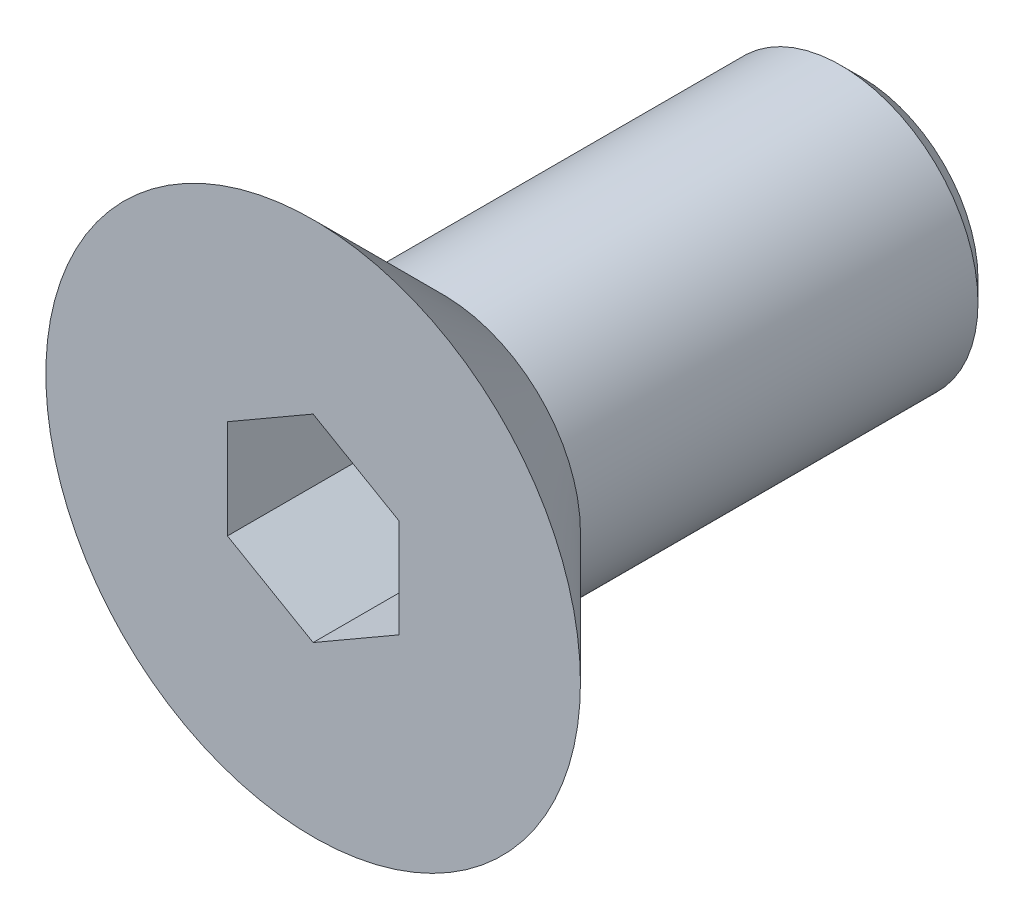
ISO-10303-21;
HEADER;
FILE_DESCRIPTION(('STEP AP214'),'2;1');
FILE_NAME('part.step','',(''),(''),'','','');
FILE_SCHEMA(('AUTOMOTIVE_DESIGN { 1 0 10303 214 1 1 1 1 }'));
ENDSEC;
DATA;
#1=APPLICATION_CONTEXT('core data for automotive mechanical design processes');
#2=APPLICATION_PROTOCOL_DEFINITION('international standard','automotive_design',2000,#1);
#3=PRODUCT_CONTEXT('',#1,'mechanical');
#4=PRODUCT('Part','Part','',(#3));
#5=PRODUCT_RELATED_PRODUCT_CATEGORY('part','',(#4));
#6=PRODUCT_DEFINITION_FORMATION('','',#4);
#7=PRODUCT_DEFINITION_CONTEXT('part definition',#1,'design');
#8=PRODUCT_DEFINITION('design','',#6,#7);
#9=PRODUCT_DEFINITION_SHAPE('','',#8);
#10=(LENGTH_UNIT() NAMED_UNIT(*) SI_UNIT(.MILLI.,.METRE.));
#11=(NAMED_UNIT(*) PLANE_ANGLE_UNIT() SI_UNIT($,.RADIAN.));
#12=(NAMED_UNIT(*) SI_UNIT($,.STERADIAN.) SOLID_ANGLE_UNIT());
#13=UNCERTAINTY_MEASURE_WITH_UNIT(LENGTH_MEASURE(1.E-05),#10,'distance_accuracy_value','');
#14=(GEOMETRIC_REPRESENTATION_CONTEXT(3) GLOBAL_UNCERTAINTY_ASSIGNED_CONTEXT((#13)) GLOBAL_UNIT_ASSIGNED_CONTEXT((#10,
#11,#12)) REPRESENTATION_CONTEXT('',''));
#15=CARTESIAN_POINT('',(0.,0.,0.));
#16=DIRECTION('',(0.,0.,1.));
#17=DIRECTION('',(1.,0.,0.));
#18=AXIS2_PLACEMENT_3D('',#15,#16,#17);
#19=CARTESIAN_POINT('',(0.,0.,2.3));
#20=DIRECTION('',(0.,0.,1.));
#21=DIRECTION('',(1.,0.,0.));
#22=AXIS2_PLACEMENT_3D('',#19,#20,#21);
#23=PLANE('',#22);
#24=CARTESIAN_POINT('',(0.,0.,2.3));
#25=DIRECTION('',(0.,0.,1.));
#26=DIRECTION('',(1.,0.,0.));
#27=AXIS2_PLACEMENT_3D('',#24,#25,#26);
#28=CIRCLE('',#27,3.89999999999996);
#29=CARTESIAN_POINT('',(3.89999999999996,0.,2.3));
#30=VERTEX_POINT('',#29);
#31=EDGE_CURVE('E42',#30,#30,#28,.T.);
#32=ORIENTED_EDGE('',*,*,#31,.T.);
#33=EDGE_LOOP('',(#32));
#34=FACE_BOUND('',#33,.T.);
#35=DIRECTION('',(-0.866025403784439,0.5,0.));
#36=VECTOR('',#35,1.);
#37=CARTESIAN_POINT('',(1.25,0.721687836487033,2.3));
#38=LINE('',#37,#36);
#39=CARTESIAN_POINT('',(1.25,0.721687836487033,2.3));
#40=VERTEX_POINT('',#39);
#41=CARTESIAN_POINT('',(0.,1.44337567297406,2.3));
#42=VERTEX_POINT('',#41);
#43=EDGE_CURVE('E49',#40,#42,#38,.T.);
#44=ORIENTED_EDGE('',*,*,#43,.F.);
#45=DIRECTION('',(0.,1.,0.));
#46=VECTOR('',#45,1.);
#47=CARTESIAN_POINT('',(1.25,-0.721687836487033,2.3));
#48=LINE('',#47,#46);
#49=CARTESIAN_POINT('',(1.25,-0.721687836487033,2.3));
#50=VERTEX_POINT('',#49);
#51=EDGE_CURVE('E132',#50,#40,#48,.T.);
#52=ORIENTED_EDGE('',*,*,#51,.F.);
#53=DIRECTION('',(0.866025403784439,0.5,0.));
#54=VECTOR('',#53,1.);
#55=CARTESIAN_POINT('',(0.,-1.44337567297406,2.3));
#56=LINE('',#55,#54);
#57=CARTESIAN_POINT('',(0.,-1.44337567297406,2.3));
#58=VERTEX_POINT('',#57);
#59=EDGE_CURVE('E130',#58,#50,#56,.T.);
#60=ORIENTED_EDGE('',*,*,#59,.F.);
#61=DIRECTION('',(0.866025403784439,-0.5,0.));
#62=VECTOR('',#61,1.);
#63=CARTESIAN_POINT('',(-1.25,-0.721687836487032,2.3));
#64=LINE('',#63,#62);
#65=CARTESIAN_POINT('',(-1.25,-0.721687836487032,2.3));
#66=VERTEX_POINT('',#65);
#67=EDGE_CURVE('E97',#66,#58,#64,.T.);
#68=ORIENTED_EDGE('',*,*,#67,.F.);
#69=DIRECTION('',(0.,-1.,0.));
#70=VECTOR('',#69,1.);
#71=CARTESIAN_POINT('',(-1.25,0.721687836487033,2.3));
#72=LINE('',#71,#70);
#73=CARTESIAN_POINT('',(-1.25,0.721687836487033,2.3));
#74=VERTEX_POINT('',#73);
#75=EDGE_CURVE('E126',#74,#66,#72,.T.);
#76=ORIENTED_EDGE('',*,*,#75,.F.);
#77=DIRECTION('',(-0.866025403784439,-0.5,0.));
#78=VECTOR('',#77,1.);
#79=CARTESIAN_POINT('',(0.,1.44337567297406,2.3));
#80=LINE('',#79,#78);
#81=EDGE_CURVE('E123',#42,#74,#80,.T.);
#82=ORIENTED_EDGE('',*,*,#81,.F.);
#83=EDGE_LOOP('',(#44,#52,#60,#68,#76,#82));
#84=FACE_BOUND('',#83,.T.);
#85=ADVANCED_FACE('F34',(#34,#84),#23,.T.);
#86=CARTESIAN_POINT('',(0.,0.,-5.7));
#87=DIRECTION('',(0.,0.,1.));
#88=DIRECTION('',(1.,0.,0.));
#89=AXIS2_PLACEMENT_3D('',#86,#87,#88);
#90=CYLINDRICAL_SURFACE('',#89,2.);
#91=CARTESIAN_POINT('',(0.,0.,0.400000000000021));
#92=DIRECTION('',(0.,0.,1.));
#93=DIRECTION('',(1.,0.,0.));
#94=AXIS2_PLACEMENT_3D('',#91,#92,#93);
#95=CIRCLE('',#94,2.);
#96=CARTESIAN_POINT('',(2.,0.,0.400000000000021));
#97=VERTEX_POINT('',#96);
#98=EDGE_CURVE('E11',#97,#97,#95,.F.);
#99=ORIENTED_EDGE('',*,*,#98,.T.);
#100=EDGE_LOOP('',(#99));
#101=FACE_BOUND('',#100,.T.);
#102=CARTESIAN_POINT('',(0.,0.,-5.4));
#103=DIRECTION('',(0.,0.,-1.));
#104=DIRECTION('',(-1.,0.,0.));
#105=AXIS2_PLACEMENT_3D('',#102,#103,#104);
#106=CIRCLE('',#105,2.);
#107=CARTESIAN_POINT('',(-2.,0.,-5.4));
#108=VERTEX_POINT('',#107);
#109=EDGE_CURVE('E144',#108,#108,#106,.F.);
#110=ORIENTED_EDGE('',*,*,#109,.T.);
#111=EDGE_LOOP('',(#110));
#112=FACE_BOUND('',#111,.T.);
#113=ADVANCED_FACE('F160',(#101,#112),#90,.T.);
#114=CARTESIAN_POINT('',(0.,0.,-5.7));
#115=DIRECTION('',(0.,0.,-1.));
#116=DIRECTION('',(-1.,0.,0.));
#117=AXIS2_PLACEMENT_3D('',#114,#115,#116);
#118=PLANE('',#117);
#119=CARTESIAN_POINT('',(0.,0.,-5.7));
#120=DIRECTION('',(0.,0.,-1.));
#121=DIRECTION('',(-1.,0.,0.));
#122=AXIS2_PLACEMENT_3D('',#119,#120,#121);
#123=CIRCLE('',#122,1.7);
#124=CARTESIAN_POINT('',(-1.7,0.,-5.7));
#125=VERTEX_POINT('',#124);
#126=EDGE_CURVE('E136',#125,#125,#123,.T.);
#127=ORIENTED_EDGE('',*,*,#126,.T.);
#128=EDGE_LOOP('',(#127));
#129=FACE_BOUND('',#128,.T.);
#130=ADVANCED_FACE('F165',(#129),#118,.T.);
#131=CARTESIAN_POINT('',(0.,0.,-5.7));
#132=DIRECTION('',(0.,0.,1.));
#133=DIRECTION('',(1.,0.,0.));
#134=AXIS2_PLACEMENT_3D('',#131,#132,#133);
#135=CONICAL_SURFACE('',#134,1.7,0.785398163397447);
#136=ORIENTED_EDGE('',*,*,#109,.F.);
#137=EDGE_LOOP('',(#136));
#138=FACE_BOUND('',#137,.T.);
#139=ORIENTED_EDGE('',*,*,#126,.F.);
#140=EDGE_LOOP('',(#139));
#141=FACE_BOUND('',#140,.T.);
#142=ADVANCED_FACE('F169',(#138,#141),#135,.T.);
#143=CARTESIAN_POINT('',(1.25,0.721687836487033,0.3));
#144=DIRECTION('',(0.5,0.866025403784439,0.));
#145=DIRECTION('',(-0.866025403784439,0.5,0.));
#146=AXIS2_PLACEMENT_3D('',#143,#144,#145);
#147=PLANE('',#146);
#148=ORIENTED_EDGE('',*,*,#43,.T.);
#149=DIRECTION('',(0.,0.,1.));
#150=VECTOR('',#149,1.);
#151=CARTESIAN_POINT('',(0.,1.44337567297406,0.3));
#152=LINE('',#151,#150);
#153=CARTESIAN_POINT('',(0.,1.44337567297406,0.3));
#154=VERTEX_POINT('',#153);
#155=EDGE_CURVE('E79',#154,#42,#152,.T.);
#156=ORIENTED_EDGE('',*,*,#155,.F.);
#157=DIRECTION('',(-0.866025403784439,0.5,0.));
#158=VECTOR('',#157,1.);
#159=CARTESIAN_POINT('',(1.25,0.721687836487033,0.3));
#160=LINE('',#159,#158);
#161=CARTESIAN_POINT('',(1.25,0.721687836487033,0.3));
#162=VERTEX_POINT('',#161);
#163=EDGE_CURVE('E134',#162,#154,#160,.T.);
#164=ORIENTED_EDGE('',*,*,#163,.F.);
#165=DIRECTION('',(0.,0.,1.));
#166=VECTOR('',#165,1.);
#167=CARTESIAN_POINT('',(1.25,0.721687836487033,0.3));
#168=LINE('',#167,#166);
#169=EDGE_CURVE('E57',#162,#40,#168,.T.);
#170=ORIENTED_EDGE('',*,*,#169,.T.);
#171=EDGE_LOOP('',(#148,#156,#164,#170));
#172=FACE_BOUND('',#171,.T.);
#173=ADVANCED_FACE('F171',(#172),#147,.F.);
#174=CARTESIAN_POINT('',(1.25,-0.721687836487033,0.3));
#175=DIRECTION('',(1.,0.,0.));
#176=DIRECTION('',(0.,1.,0.));
#177=AXIS2_PLACEMENT_3D('',#174,#175,#176);
#178=PLANE('',#177);
#179=ORIENTED_EDGE('',*,*,#51,.T.);
#180=ORIENTED_EDGE('',*,*,#169,.F.);
#181=DIRECTION('',(0.,1.,0.));
#182=VECTOR('',#181,1.);
#183=CARTESIAN_POINT('',(1.25,-0.721687836487033,0.3));
#184=LINE('',#183,#182);
#185=CARTESIAN_POINT('',(1.25,-0.721687836487033,0.3));
#186=VERTEX_POINT('',#185);
#187=EDGE_CURVE('E109',#186,#162,#184,.T.);
#188=ORIENTED_EDGE('',*,*,#187,.F.);
#189=DIRECTION('',(0.,0.,1.));
#190=VECTOR('',#189,1.);
#191=CARTESIAN_POINT('',(1.25,-0.721687836487033,0.3));
#192=LINE('',#191,#190);
#193=EDGE_CURVE('E101',#186,#50,#192,.T.);
#194=ORIENTED_EDGE('',*,*,#193,.T.);
#195=EDGE_LOOP('',(#179,#180,#188,#194));
#196=FACE_BOUND('',#195,.T.);
#197=ADVANCED_FACE('F177',(#196),#178,.F.);
#198=CARTESIAN_POINT('',(0.,-1.44337567297406,0.3));
#199=DIRECTION('',(0.5,-0.866025403784439,0.));
#200=DIRECTION('',(0.866025403784439,0.5,0.));
#201=AXIS2_PLACEMENT_3D('',#198,#199,#200);
#202=PLANE('',#201);
#203=ORIENTED_EDGE('',*,*,#59,.T.);
#204=ORIENTED_EDGE('',*,*,#193,.F.);
#205=DIRECTION('',(0.866025403784439,0.5,0.));
#206=VECTOR('',#205,1.);
#207=CARTESIAN_POINT('',(0.,-1.44337567297406,0.3));
#208=LINE('',#207,#206);
#209=CARTESIAN_POINT('',(0.,-1.44337567297406,0.3));
#210=VERTEX_POINT('',#209);
#211=EDGE_CURVE('E105',#210,#186,#208,.T.);
#212=ORIENTED_EDGE('',*,*,#211,.F.);
#213=DIRECTION('',(0.,0.,1.));
#214=VECTOR('',#213,1.);
#215=CARTESIAN_POINT('',(0.,-1.44337567297406,0.3));
#216=LINE('',#215,#214);
#217=EDGE_CURVE('E90',#210,#58,#216,.T.);
#218=ORIENTED_EDGE('',*,*,#217,.T.);
#219=EDGE_LOOP('',(#203,#204,#212,#218));
#220=FACE_BOUND('',#219,.T.);
#221=ADVANCED_FACE('F106',(#220),#202,.F.);
#222=CARTESIAN_POINT('',(-1.25,-0.721687836487032,0.3));
#223=DIRECTION('',(-0.5,-0.866025403784439,0.));
#224=DIRECTION('',(0.866025403784439,-0.5,0.));
#225=AXIS2_PLACEMENT_3D('',#222,#223,#224);
#226=PLANE('',#225);
#227=ORIENTED_EDGE('',*,*,#67,.T.);
#228=ORIENTED_EDGE('',*,*,#217,.F.);
#229=DIRECTION('',(0.866025403784439,-0.5,0.));
#230=VECTOR('',#229,1.);
#231=CARTESIAN_POINT('',(-1.25,-0.721687836487032,0.3));
#232=LINE('',#231,#230);
#233=CARTESIAN_POINT('',(-1.25,-0.721687836487032,0.3));
#234=VERTEX_POINT('',#233);
#235=EDGE_CURVE('E94',#234,#210,#232,.T.);
#236=ORIENTED_EDGE('',*,*,#235,.F.);
#237=DIRECTION('',(0.,0.,1.));
#238=VECTOR('',#237,1.);
#239=CARTESIAN_POINT('',(-1.25,-0.721687836487032,0.3));
#240=LINE('',#239,#238);
#241=EDGE_CURVE('E102',#234,#66,#240,.T.);
#242=ORIENTED_EDGE('',*,*,#241,.T.);
#243=EDGE_LOOP('',(#227,#228,#236,#242));
#244=FACE_BOUND('',#243,.T.);
#245=ADVANCED_FACE('F92',(#244),#226,.F.);
#246=CARTESIAN_POINT('',(-1.25,0.721687836487033,0.3));
#247=DIRECTION('',(-1.,0.,0.));
#248=DIRECTION('',(0.,0.,1.));
#249=AXIS2_PLACEMENT_3D('',#246,#247,#248);
#250=PLANE('',#249);
#251=ORIENTED_EDGE('',*,*,#75,.T.);
#252=ORIENTED_EDGE('',*,*,#241,.F.);
#253=DIRECTION('',(0.,-1.,0.));
#254=VECTOR('',#253,1.);
#255=CARTESIAN_POINT('',(-1.25,0.721687836487033,0.3));
#256=LINE('',#255,#254);
#257=CARTESIAN_POINT('',(-1.25,0.721687836487033,0.3));
#258=VERTEX_POINT('',#257);
#259=EDGE_CURVE('E115',#258,#234,#256,.T.);
#260=ORIENTED_EDGE('',*,*,#259,.F.);
#261=DIRECTION('',(0.,0.,1.));
#262=VECTOR('',#261,1.);
#263=CARTESIAN_POINT('',(-1.25,0.721687836487033,0.3));
#264=LINE('',#263,#262);
#265=EDGE_CURVE('E139',#258,#74,#264,.T.);
#266=ORIENTED_EDGE('',*,*,#265,.T.);
#267=EDGE_LOOP('',(#251,#252,#260,#266));
#268=FACE_BOUND('',#267,.T.);
#269=ADVANCED_FACE('F189',(#268),#250,.F.);
#270=CARTESIAN_POINT('',(0.,1.44337567297406,0.3));
#271=DIRECTION('',(-0.5,0.866025403784439,0.));
#272=DIRECTION('',(-0.866025403784439,-0.5,0.));
#273=AXIS2_PLACEMENT_3D('',#270,#271,#272);
#274=PLANE('',#273);
#275=ORIENTED_EDGE('',*,*,#81,.T.);
#276=ORIENTED_EDGE('',*,*,#265,.F.);
#277=DIRECTION('',(-0.866025403784439,-0.5,0.));
#278=VECTOR('',#277,1.);
#279=CARTESIAN_POINT('',(0.,1.44337567297406,0.3));
#280=LINE('',#279,#278);
#281=EDGE_CURVE('E117',#154,#258,#280,.T.);
#282=ORIENTED_EDGE('',*,*,#281,.F.);
#283=ORIENTED_EDGE('',*,*,#155,.T.);
#284=EDGE_LOOP('',(#275,#276,#282,#283));
#285=FACE_BOUND('',#284,.T.);
#286=ADVANCED_FACE('F156',(#285),#274,.F.);
#287=CARTESIAN_POINT('',(0.,0.,0.3));
#288=DIRECTION('',(0.,0.,1.));
#289=DIRECTION('',(1.,0.,0.));
#290=AXIS2_PLACEMENT_3D('',#287,#288,#289);
#291=PLANE('',#290);
#292=ORIENTED_EDGE('',*,*,#163,.T.);
#293=ORIENTED_EDGE('',*,*,#281,.T.);
#294=ORIENTED_EDGE('',*,*,#259,.T.);
#295=ORIENTED_EDGE('',*,*,#235,.T.);
#296=ORIENTED_EDGE('',*,*,#211,.T.);
#297=ORIENTED_EDGE('',*,*,#187,.T.);
#298=EDGE_LOOP('',(#292,#293,#294,#295,#296,#297));
#299=FACE_BOUND('',#298,.T.);
#300=ADVANCED_FACE('F112',(#299),#291,.T.);
#301=CARTESIAN_POINT('',(0.,0.,2.40000000000004));
#302=DIRECTION('',(0.,0.,1.));
#303=DIRECTION('',(1.,0.,0.));
#304=AXIS2_PLACEMENT_3D('',#301,#302,#303);
#305=CONICAL_SURFACE('',#304,4.,0.785398163397443);
#306=ORIENTED_EDGE('',*,*,#98,.F.);
#307=EDGE_LOOP('',(#306));
#308=FACE_BOUND('',#307,.T.);
#309=ORIENTED_EDGE('',*,*,#31,.F.);
#310=EDGE_LOOP('',(#309));
#311=FACE_BOUND('',#310,.T.);
#312=ADVANCED_FACE('F36',(#308,#311),#305,.T.);
#313=CLOSED_SHELL('',(#85,#113,#130,#142,#173,#197,#221,#245,#269,#286,#300,#312));
#314=MANIFOLD_SOLID_BREP('B2',#313);
#315=ADVANCED_BREP_SHAPE_REPRESENTATION('',(#18,#314),#14);
#316=SHAPE_DEFINITION_REPRESENTATION(#9,#315);
ENDSEC;
END-ISO-10303-21;
